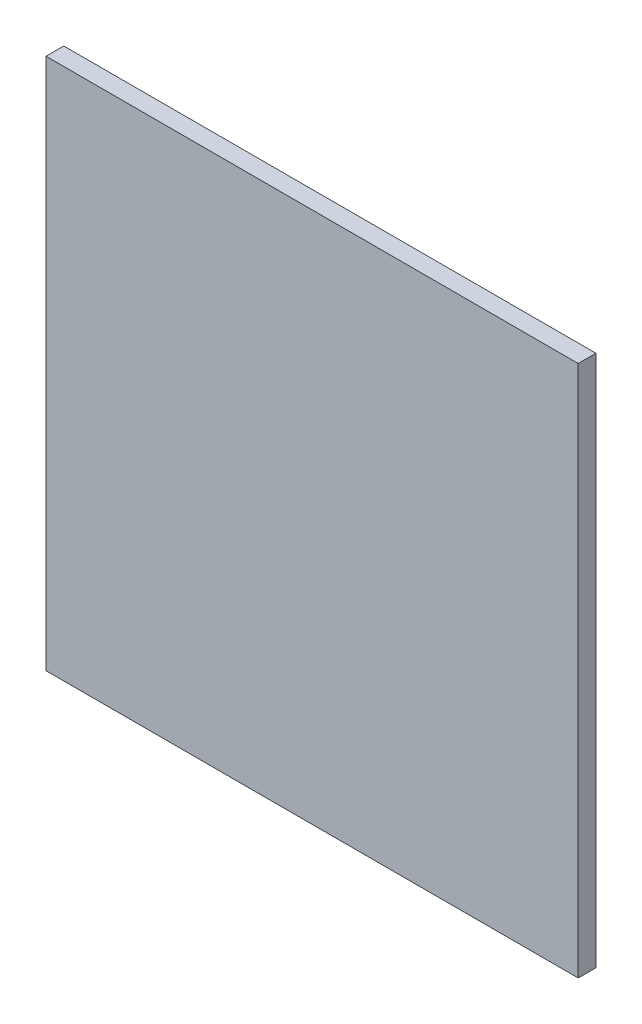
ISO-10303-21;
HEADER;
FILE_DESCRIPTION(('STEP AP214'),'2;1');
FILE_NAME('part.step','',(''),(''),'','','');
FILE_SCHEMA(('AUTOMOTIVE_DESIGN { 1 0 10303 214 1 1 1 1 }'));
ENDSEC;
DATA;
#1=APPLICATION_CONTEXT('core data for automotive mechanical design processes');
#2=APPLICATION_PROTOCOL_DEFINITION('international standard','automotive_design',2000,#1);
#3=PRODUCT_CONTEXT('',#1,'mechanical');
#4=PRODUCT('Part','Part','',(#3));
#5=PRODUCT_RELATED_PRODUCT_CATEGORY('part','',(#4));
#6=PRODUCT_DEFINITION_FORMATION('','',#4);
#7=PRODUCT_DEFINITION_CONTEXT('part definition',#1,'design');
#8=PRODUCT_DEFINITION('design','',#6,#7);
#9=PRODUCT_DEFINITION_SHAPE('','',#8);
#10=(LENGTH_UNIT() NAMED_UNIT(*) SI_UNIT(.MILLI.,.METRE.));
#11=(NAMED_UNIT(*) PLANE_ANGLE_UNIT() SI_UNIT($,.RADIAN.));
#12=(NAMED_UNIT(*) SI_UNIT($,.STERADIAN.) SOLID_ANGLE_UNIT());
#13=UNCERTAINTY_MEASURE_WITH_UNIT(LENGTH_MEASURE(1.E-05),#10,'distance_accuracy_value','');
#14=(GEOMETRIC_REPRESENTATION_CONTEXT(3) GLOBAL_UNCERTAINTY_ASSIGNED_CONTEXT((#13)) GLOBAL_UNIT_ASSIGNED_CONTEXT((#10,
#11,#12)) REPRESENTATION_CONTEXT('',''));
#15=CARTESIAN_POINT('',(0.,0.,0.));
#16=DIRECTION('',(0.,0.,1.));
#17=DIRECTION('',(1.,0.,0.));
#18=AXIS2_PLACEMENT_3D('',#15,#16,#17);
#19=CARTESIAN_POINT('',(-81.3088447053612,12.9222972972973,10.));
#20=DIRECTION('',(1.,0.,0.));
#21=DIRECTION('',(0.,1.,0.));
#22=AXIS2_PLACEMENT_3D('',#19,#20,#21);
#23=PLANE('',#22);
#24=DIRECTION('',(0.,-1.,0.));
#25=VECTOR('',#24,1.);
#26=CARTESIAN_POINT('',(-81.3088447053612,12.9222972972973,0.));
#27=LINE('',#26,#25);
#28=CARTESIAN_POINT('',(-81.3088447053612,12.9222972972973,0.));
#29=VERTEX_POINT('',#28);
#30=CARTESIAN_POINT('',(-81.3088447053611,-287.077702702703,0.));
#31=VERTEX_POINT('',#30);
#32=EDGE_CURVE('E95',#29,#31,#27,.T.);
#33=ORIENTED_EDGE('',*,*,#32,.T.);
#34=DIRECTION('',(0.,0.,-1.));
#35=VECTOR('',#34,1.);
#36=CARTESIAN_POINT('',(-81.3088447053611,-287.077702702703,10.));
#37=LINE('',#36,#35);
#38=CARTESIAN_POINT('',(-81.3088447053611,-287.077702702703,10.));
#39=VERTEX_POINT('',#38);
#40=EDGE_CURVE('E11',#39,#31,#37,.T.);
#41=ORIENTED_EDGE('',*,*,#40,.F.);
#42=DIRECTION('',(0.,-1.,0.));
#43=VECTOR('',#42,1.);
#44=CARTESIAN_POINT('',(-81.3088447053612,12.9222972972973,10.));
#45=LINE('',#44,#43);
#46=CARTESIAN_POINT('',(-81.3088447053612,12.9222972972973,10.));
#47=VERTEX_POINT('',#46);
#48=EDGE_CURVE('E83',#47,#39,#45,.T.);
#49=ORIENTED_EDGE('',*,*,#48,.F.);
#50=DIRECTION('',(0.,0.,-1.));
#51=VECTOR('',#50,1.);
#52=CARTESIAN_POINT('',(-81.3088447053612,12.9222972972973,10.));
#53=LINE('',#52,#51);
#54=EDGE_CURVE('E91',#47,#29,#53,.T.);
#55=ORIENTED_EDGE('',*,*,#54,.T.);
#56=EDGE_LOOP('',(#33,#41,#49,#55));
#57=FACE_BOUND('',#56,.T.);
#58=ADVANCED_FACE('F32',(#57),#23,.F.);
#59=CARTESIAN_POINT('',(-81.3088447053611,-287.077702702703,10.));
#60=DIRECTION('',(0.,1.,0.));
#61=DIRECTION('',(0.,0.,1.));
#62=AXIS2_PLACEMENT_3D('',#59,#60,#61);
#63=PLANE('',#62);
#64=DIRECTION('',(1.,0.,0.));
#65=VECTOR('',#64,1.);
#66=CARTESIAN_POINT('',(-81.3088447053611,-287.077702702703,0.));
#67=LINE('',#66,#65);
#68=CARTESIAN_POINT('',(218.691155294639,-287.077702702703,0.));
#69=VERTEX_POINT('',#68);
#70=EDGE_CURVE('E87',#31,#69,#67,.T.);
#71=ORIENTED_EDGE('',*,*,#70,.T.);
#72=DIRECTION('',(0.,0.,-1.));
#73=VECTOR('',#72,1.);
#74=CARTESIAN_POINT('',(218.691155294639,-287.077702702703,10.));
#75=LINE('',#74,#73);
#76=CARTESIAN_POINT('',(218.691155294639,-287.077702702703,10.));
#77=VERTEX_POINT('',#76);
#78=EDGE_CURVE('E40',#77,#69,#75,.T.);
#79=ORIENTED_EDGE('',*,*,#78,.F.);
#80=DIRECTION('',(1.,0.,0.));
#81=VECTOR('',#80,1.);
#82=CARTESIAN_POINT('',(-81.3088447053611,-287.077702702703,10.));
#83=LINE('',#82,#81);
#84=EDGE_CURVE('E78',#39,#77,#83,.T.);
#85=ORIENTED_EDGE('',*,*,#84,.F.);
#86=ORIENTED_EDGE('',*,*,#40,.T.);
#87=EDGE_LOOP('',(#71,#79,#85,#86));
#88=FACE_BOUND('',#87,.T.);
#89=ADVANCED_FACE('F86',(#88),#63,.F.);
#90=CARTESIAN_POINT('',(218.691155294639,12.9222972972973,10.));
#91=DIRECTION('',(-1.,0.,0.));
#92=DIRECTION('',(0.,-1.,0.));
#93=AXIS2_PLACEMENT_3D('',#90,#91,#92);
#94=PLANE('',#93);
#95=DIRECTION('',(0.,1.,0.));
#96=VECTOR('',#95,1.);
#97=CARTESIAN_POINT('',(218.691155294639,12.9222972972973,0.));
#98=LINE('',#97,#96);
#99=CARTESIAN_POINT('',(218.691155294639,12.9222972972973,0.));
#100=VERTEX_POINT('',#99);
#101=EDGE_CURVE('E65',#69,#100,#98,.T.);
#102=ORIENTED_EDGE('',*,*,#101,.T.);
#103=DIRECTION('',(0.,0.,-1.));
#104=VECTOR('',#103,1.);
#105=CARTESIAN_POINT('',(218.691155294639,12.9222972972973,10.));
#106=LINE('',#105,#104);
#107=CARTESIAN_POINT('',(218.691155294639,12.9222972972973,10.));
#108=VERTEX_POINT('',#107);
#109=EDGE_CURVE('E88',#108,#100,#106,.T.);
#110=ORIENTED_EDGE('',*,*,#109,.F.);
#111=DIRECTION('',(0.,1.,0.));
#112=VECTOR('',#111,1.);
#113=CARTESIAN_POINT('',(218.691155294639,12.9222972972973,10.));
#114=LINE('',#113,#112);
#115=EDGE_CURVE('E81',#77,#108,#114,.T.);
#116=ORIENTED_EDGE('',*,*,#115,.F.);
#117=ORIENTED_EDGE('',*,*,#78,.T.);
#118=EDGE_LOOP('',(#102,#110,#116,#117));
#119=FACE_BOUND('',#118,.T.);
#120=ADVANCED_FACE('F89',(#119),#94,.F.);
#121=CARTESIAN_POINT('',(-81.3088447053612,12.9222972972973,10.));
#122=DIRECTION('',(0.,-1.,0.));
#123=DIRECTION('',(0.,0.,-1.));
#124=AXIS2_PLACEMENT_3D('',#121,#122,#123);
#125=PLANE('',#124);
#126=DIRECTION('',(-1.,0.,0.));
#127=VECTOR('',#126,1.);
#128=CARTESIAN_POINT('',(-81.3088447053612,12.9222972972973,0.));
#129=LINE('',#128,#127);
#130=EDGE_CURVE('E71',#100,#29,#129,.T.);
#131=ORIENTED_EDGE('',*,*,#130,.T.);
#132=ORIENTED_EDGE('',*,*,#54,.F.);
#133=DIRECTION('',(-1.,0.,0.));
#134=VECTOR('',#133,1.);
#135=CARTESIAN_POINT('',(-81.3088447053612,12.9222972972973,10.));
#136=LINE('',#135,#134);
#137=EDGE_CURVE('E48',#108,#47,#136,.T.);
#138=ORIENTED_EDGE('',*,*,#137,.F.);
#139=ORIENTED_EDGE('',*,*,#109,.T.);
#140=EDGE_LOOP('',(#131,#132,#138,#139));
#141=FACE_BOUND('',#140,.T.);
#142=ADVANCED_FACE('F102',(#141),#125,.F.);
#143=CARTESIAN_POINT('',(0.,0.,10.));
#144=DIRECTION('',(0.,0.,1.));
#145=DIRECTION('',(1.,0.,0.));
#146=AXIS2_PLACEMENT_3D('',#143,#144,#145);
#147=PLANE('',#146);
#148=ORIENTED_EDGE('',*,*,#48,.T.);
#149=ORIENTED_EDGE('',*,*,#84,.T.);
#150=ORIENTED_EDGE('',*,*,#115,.T.);
#151=ORIENTED_EDGE('',*,*,#137,.T.);
#152=EDGE_LOOP('',(#148,#149,#150,#151));
#153=FACE_BOUND('',#152,.T.);
#154=ADVANCED_FACE('F79',(#153),#147,.T.);
#155=CARTESIAN_POINT('',(0.,0.,0.));
#156=DIRECTION('',(0.,0.,1.));
#157=DIRECTION('',(1.,0.,0.));
#158=AXIS2_PLACEMENT_3D('',#155,#156,#157);
#159=PLANE('',#158);
#160=ORIENTED_EDGE('',*,*,#32,.F.);
#161=ORIENTED_EDGE('',*,*,#130,.F.);
#162=ORIENTED_EDGE('',*,*,#101,.F.);
#163=ORIENTED_EDGE('',*,*,#70,.F.);
#164=EDGE_LOOP('',(#160,#161,#162,#163));
#165=FACE_BOUND('',#164,.T.);
#166=ADVANCED_FACE('F105',(#165),#159,.F.);
#167=CLOSED_SHELL('',(#58,#89,#120,#142,#154,#166));
#168=MANIFOLD_SOLID_BREP('B2',#167);
#169=ADVANCED_BREP_SHAPE_REPRESENTATION('',(#18,#168),#14);
#170=SHAPE_DEFINITION_REPRESENTATION(#9,#169);
ENDSEC;
END-ISO-10303-21;
